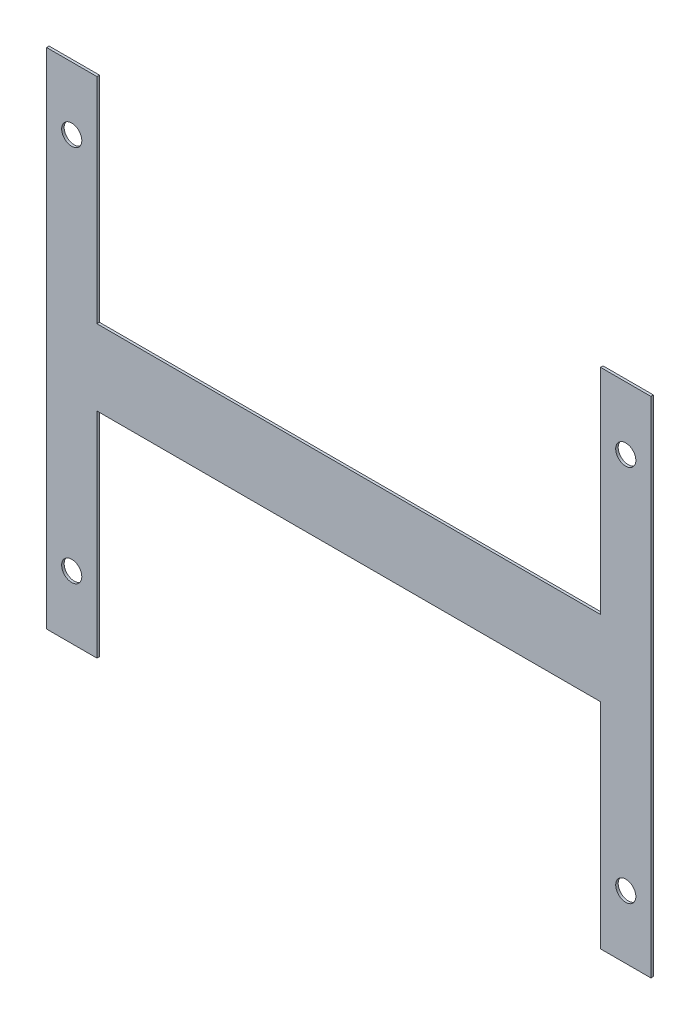
ISO-10303-21;
HEADER;
FILE_DESCRIPTION(('STEP AP214'),'2;1');
FILE_NAME('part.step','',(''),(''),'','','');
FILE_SCHEMA(('AUTOMOTIVE_DESIGN { 1 0 10303 214 1 1 1 1 }'));
ENDSEC;
DATA;
#1=APPLICATION_CONTEXT('core data for automotive mechanical design processes');
#2=APPLICATION_PROTOCOL_DEFINITION('international standard','automotive_design',2000,#1);
#3=PRODUCT_CONTEXT('',#1,'mechanical');
#4=PRODUCT('Part','Part','',(#3));
#5=PRODUCT_RELATED_PRODUCT_CATEGORY('part','',(#4));
#6=PRODUCT_DEFINITION_FORMATION('','',#4);
#7=PRODUCT_DEFINITION_CONTEXT('part definition',#1,'design');
#8=PRODUCT_DEFINITION('design','',#6,#7);
#9=PRODUCT_DEFINITION_SHAPE('','',#8);
#10=(LENGTH_UNIT() NAMED_UNIT(*) SI_UNIT(.MILLI.,.METRE.));
#11=(NAMED_UNIT(*) PLANE_ANGLE_UNIT() SI_UNIT($,.RADIAN.));
#12=(NAMED_UNIT(*) SI_UNIT($,.STERADIAN.) SOLID_ANGLE_UNIT());
#13=UNCERTAINTY_MEASURE_WITH_UNIT(LENGTH_MEASURE(1.E-05),#10,'distance_accuracy_value','');
#14=(GEOMETRIC_REPRESENTATION_CONTEXT(3) GLOBAL_UNCERTAINTY_ASSIGNED_CONTEXT((#13)) GLOBAL_UNIT_ASSIGNED_CONTEXT((#10,
#11,#12)) REPRESENTATION_CONTEXT('',''));
#15=CARTESIAN_POINT('',(0.,0.,0.));
#16=DIRECTION('',(0.,0.,1.));
#17=DIRECTION('',(1.,0.,0.));
#18=AXIS2_PLACEMENT_3D('',#15,#16,#17);
#19=CARTESIAN_POINT('',(0.,85.,1.));
#20=DIRECTION('',(0.,1.,0.));
#21=DIRECTION('',(-1.,0.,0.));
#22=AXIS2_PLACEMENT_3D('',#19,#20,#21);
#23=PLANE('',#22);
#24=DIRECTION('',(1.,0.,0.));
#25=VECTOR('',#24,1.);
#26=CARTESIAN_POINT('',(0.,85.,0.));
#27=LINE('',#26,#25);
#28=CARTESIAN_POINT('',(20.,85.,0.));
#29=VERTEX_POINT('',#28);
#30=CARTESIAN_POINT('',(220.,85.,0.));
#31=VERTEX_POINT('',#30);
#32=EDGE_CURVE('E170',#29,#31,#27,.T.);
#33=ORIENTED_EDGE('',*,*,#32,.T.);
#34=DIRECTION('',(0.,0.,-1.));
#35=VECTOR('',#34,1.);
#36=CARTESIAN_POINT('',(220.,85.,1.));
#37=LINE('',#36,#35);
#38=CARTESIAN_POINT('',(220.,85.,1.));
#39=VERTEX_POINT('',#38);
#40=EDGE_CURVE('E11',#39,#31,#37,.T.);
#41=ORIENTED_EDGE('',*,*,#40,.F.);
#42=DIRECTION('',(1.,0.,0.));
#43=VECTOR('',#42,1.);
#44=CARTESIAN_POINT('',(0.,85.,1.));
#45=LINE('',#44,#43);
#46=CARTESIAN_POINT('',(20.,85.,1.));
#47=VERTEX_POINT('',#46);
#48=EDGE_CURVE('E209',#47,#39,#45,.T.);
#49=ORIENTED_EDGE('',*,*,#48,.F.);
#50=DIRECTION('',(0.,0.,-1.));
#51=VECTOR('',#50,1.);
#52=CARTESIAN_POINT('',(20.,85.,1.));
#53=LINE('',#52,#51);
#54=EDGE_CURVE('E51',#47,#29,#53,.T.);
#55=ORIENTED_EDGE('',*,*,#54,.T.);
#56=EDGE_LOOP('',(#33,#41,#49,#55));
#57=FACE_BOUND('',#56,.T.);
#58=ADVANCED_FACE('F35',(#57),#23,.F.);
#59=CARTESIAN_POINT('',(220.,5.49560397189453E-13,1.));
#60=DIRECTION('',(1.,0.,0.));
#61=DIRECTION('',(0.,1.,0.));
#62=AXIS2_PLACEMENT_3D('',#59,#60,#61);
#63=PLANE('',#62);
#64=DIRECTION('',(0.,-1.,0.));
#65=VECTOR('',#64,1.);
#66=CARTESIAN_POINT('',(220.,5.49560397189453E-13,0.));
#67=LINE('',#66,#65);
#68=CARTESIAN_POINT('',(220.,6.10622663543836E-13,0.));
#69=VERTEX_POINT('',#68);
#70=EDGE_CURVE('E172',#31,#69,#67,.T.);
#71=ORIENTED_EDGE('',*,*,#70,.T.);
#72=DIRECTION('',(0.,0.,-1.));
#73=VECTOR('',#72,1.);
#74=CARTESIAN_POINT('',(220.,6.10622663543836E-13,1.));
#75=LINE('',#74,#73);
#76=CARTESIAN_POINT('',(220.,6.10622663543836E-13,1.));
#77=VERTEX_POINT('',#76);
#78=EDGE_CURVE('E43',#77,#69,#75,.T.);
#79=ORIENTED_EDGE('',*,*,#78,.F.);
#80=DIRECTION('',(0.,-1.,0.));
#81=VECTOR('',#80,1.);
#82=CARTESIAN_POINT('',(220.,5.49560397189453E-13,1.));
#83=LINE('',#82,#81);
#84=EDGE_CURVE('E102',#39,#77,#83,.T.);
#85=ORIENTED_EDGE('',*,*,#84,.F.);
#86=ORIENTED_EDGE('',*,*,#40,.T.);
#87=EDGE_LOOP('',(#71,#79,#85,#86));
#88=FACE_BOUND('',#87,.T.);
#89=ADVANCED_FACE('F231',(#88),#63,.F.);
#90=CARTESIAN_POINT('',(0.,0.,1.));
#91=DIRECTION('',(0.,-1.,0.));
#92=DIRECTION('',(1.,0.,0.));
#93=AXIS2_PLACEMENT_3D('',#90,#91,#92);
#94=PLANE('',#93);
#95=DIRECTION('',(-1.,0.,0.));
#96=VECTOR('',#95,1.);
#97=CARTESIAN_POINT('',(0.,0.,0.));
#98=LINE('',#97,#96);
#99=CARTESIAN_POINT('',(240.,6.66133814775094E-13,0.));
#100=VERTEX_POINT('',#99);
#101=EDGE_CURVE('E175',#100,#69,#98,.T.);
#102=ORIENTED_EDGE('',*,*,#101,.F.);
#103=DIRECTION('',(0.,0.,-1.));
#104=VECTOR('',#103,1.);
#105=CARTESIAN_POINT('',(240.,6.66133814775094E-13,1.));
#106=LINE('',#105,#104);
#107=CARTESIAN_POINT('',(240.,6.66133814775094E-13,1.));
#108=VERTEX_POINT('',#107);
#109=EDGE_CURVE('E224',#108,#100,#106,.T.);
#110=ORIENTED_EDGE('',*,*,#109,.F.);
#111=DIRECTION('',(-1.,0.,0.));
#112=VECTOR('',#111,1.);
#113=CARTESIAN_POINT('',(0.,0.,1.));
#114=LINE('',#113,#112);
#115=EDGE_CURVE('E230',#108,#77,#114,.T.);
#116=ORIENTED_EDGE('',*,*,#115,.T.);
#117=ORIENTED_EDGE('',*,*,#78,.T.);
#118=EDGE_LOOP('',(#102,#110,#116,#117));
#119=FACE_BOUND('',#118,.T.);
#120=ADVANCED_FACE('F228',(#119),#94,.T.);
#121=CARTESIAN_POINT('',(240.,6.66133814775095E-13,1.));
#122=DIRECTION('',(1.,0.,0.));
#123=DIRECTION('',(0.,1.,0.));
#124=AXIS2_PLACEMENT_3D('',#121,#122,#123);
#125=PLANE('',#124);
#126=DIRECTION('',(0.,-1.,0.));
#127=VECTOR('',#126,1.);
#128=CARTESIAN_POINT('',(240.,6.66133814775095E-13,0.));
#129=LINE('',#128,#127);
#130=CARTESIAN_POINT('',(240.,200.,0.));
#131=VERTEX_POINT('',#130);
#132=EDGE_CURVE('E179',#131,#100,#129,.T.);
#133=ORIENTED_EDGE('',*,*,#132,.F.);
#134=DIRECTION('',(0.,0.,-1.));
#135=VECTOR('',#134,1.);
#136=CARTESIAN_POINT('',(240.,200.,1.));
#137=LINE('',#136,#135);
#138=CARTESIAN_POINT('',(240.,200.,1.));
#139=VERTEX_POINT('',#138);
#140=EDGE_CURVE('E222',#139,#131,#137,.T.);
#141=ORIENTED_EDGE('',*,*,#140,.F.);
#142=DIRECTION('',(0.,-1.,0.));
#143=VECTOR('',#142,1.);
#144=CARTESIAN_POINT('',(240.,6.66133814775095E-13,1.));
#145=LINE('',#144,#143);
#146=EDGE_CURVE('E244',#139,#108,#145,.T.);
#147=ORIENTED_EDGE('',*,*,#146,.T.);
#148=ORIENTED_EDGE('',*,*,#109,.T.);
#149=EDGE_LOOP('',(#133,#141,#147,#148));
#150=FACE_BOUND('',#149,.T.);
#151=ADVANCED_FACE('F240',(#150),#125,.T.);
#152=CARTESIAN_POINT('',(-5.55111512312578E-13,200.,1.));
#153=DIRECTION('',(0.,-1.,0.));
#154=DIRECTION('',(1.,0.,0.));
#155=AXIS2_PLACEMENT_3D('',#152,#153,#154);
#156=PLANE('',#155);
#157=DIRECTION('',(-1.,0.,0.));
#158=VECTOR('',#157,1.);
#159=CARTESIAN_POINT('',(-5.55111512312578E-13,200.,0.));
#160=LINE('',#159,#158);
#161=CARTESIAN_POINT('',(220.,200.,0.));
#162=VERTEX_POINT('',#161);
#163=EDGE_CURVE('E182',#131,#162,#160,.T.);
#164=ORIENTED_EDGE('',*,*,#163,.T.);
#165=DIRECTION('',(0.,0.,-1.));
#166=VECTOR('',#165,1.);
#167=CARTESIAN_POINT('',(220.,200.,1.));
#168=LINE('',#167,#166);
#169=CARTESIAN_POINT('',(220.,200.,1.));
#170=VERTEX_POINT('',#169);
#171=EDGE_CURVE('E219',#170,#162,#168,.T.);
#172=ORIENTED_EDGE('',*,*,#171,.F.);
#173=DIRECTION('',(-1.,0.,0.));
#174=VECTOR('',#173,1.);
#175=CARTESIAN_POINT('',(-5.55111512312578E-13,200.,1.));
#176=LINE('',#175,#174);
#177=EDGE_CURVE('E246',#139,#170,#176,.T.);
#178=ORIENTED_EDGE('',*,*,#177,.F.);
#179=ORIENTED_EDGE('',*,*,#140,.T.);
#180=EDGE_LOOP('',(#164,#172,#178,#179));
#181=FACE_BOUND('',#180,.T.);
#182=ADVANCED_FACE('F292',(#181),#156,.F.);
#183=CARTESIAN_POINT('',(220.,115.,0.));
#184=VERTEX_POINT('',#183);
#185=EDGE_CURVE('E176',#162,#184,#67,.T.);
#186=ORIENTED_EDGE('',*,*,#185,.T.);
#187=DIRECTION('',(0.,0.,-1.));
#188=VECTOR('',#187,1.);
#189=CARTESIAN_POINT('',(220.,115.,1.));
#190=LINE('',#189,#188);
#191=CARTESIAN_POINT('',(220.,115.,1.));
#192=VERTEX_POINT('',#191);
#193=EDGE_CURVE('E217',#192,#184,#190,.T.);
#194=ORIENTED_EDGE('',*,*,#193,.F.);
#195=EDGE_CURVE('E249',#170,#192,#83,.T.);
#196=ORIENTED_EDGE('',*,*,#195,.F.);
#197=ORIENTED_EDGE('',*,*,#171,.T.);
#198=EDGE_LOOP('',(#186,#194,#196,#197));
#199=FACE_BOUND('',#198,.T.);
#200=ADVANCED_FACE('F285',(#199),#63,.F.);
#201=CARTESIAN_POINT('',(0.,115.,1.));
#202=DIRECTION('',(0.,1.,0.));
#203=DIRECTION('',(0.,0.,1.));
#204=AXIS2_PLACEMENT_3D('',#201,#202,#203);
#205=PLANE('',#204);
#206=DIRECTION('',(1.,0.,0.));
#207=VECTOR('',#206,1.);
#208=CARTESIAN_POINT('',(0.,115.,0.));
#209=LINE('',#208,#207);
#210=CARTESIAN_POINT('',(20.,115.,0.));
#211=VERTEX_POINT('',#210);
#212=EDGE_CURVE('E184',#211,#184,#209,.T.);
#213=ORIENTED_EDGE('',*,*,#212,.F.);
#214=DIRECTION('',(0.,0.,-1.));
#215=VECTOR('',#214,1.);
#216=CARTESIAN_POINT('',(20.,115.,1.));
#217=LINE('',#216,#215);
#218=CARTESIAN_POINT('',(20.,115.,1.));
#219=VERTEX_POINT('',#218);
#220=EDGE_CURVE('E215',#219,#211,#217,.T.);
#221=ORIENTED_EDGE('',*,*,#220,.F.);
#222=DIRECTION('',(1.,0.,0.));
#223=VECTOR('',#222,1.);
#224=CARTESIAN_POINT('',(0.,115.,1.));
#225=LINE('',#224,#223);
#226=EDGE_CURVE('E253',#219,#192,#225,.T.);
#227=ORIENTED_EDGE('',*,*,#226,.T.);
#228=ORIENTED_EDGE('',*,*,#193,.T.);
#229=EDGE_LOOP('',(#213,#221,#227,#228));
#230=FACE_BOUND('',#229,.T.);
#231=ADVANCED_FACE('F278',(#230),#205,.T.);
#232=CARTESIAN_POINT('',(20.,0.,1.));
#233=DIRECTION('',(1.,0.,0.));
#234=DIRECTION('',(0.,1.,0.));
#235=AXIS2_PLACEMENT_3D('',#232,#233,#234);
#236=PLANE('',#235);
#237=DIRECTION('',(0.,-1.,0.));
#238=VECTOR('',#237,1.);
#239=CARTESIAN_POINT('',(20.,0.,0.));
#240=LINE('',#239,#238);
#241=CARTESIAN_POINT('',(20.,200.,0.));
#242=VERTEX_POINT('',#241);
#243=EDGE_CURVE('E187',#242,#211,#240,.T.);
#244=ORIENTED_EDGE('',*,*,#243,.F.);
#245=DIRECTION('',(0.,0.,-1.));
#246=VECTOR('',#245,1.);
#247=CARTESIAN_POINT('',(20.,200.,1.));
#248=LINE('',#247,#246);
#249=CARTESIAN_POINT('',(20.,200.,1.));
#250=VERTEX_POINT('',#249);
#251=EDGE_CURVE('E213',#250,#242,#248,.T.);
#252=ORIENTED_EDGE('',*,*,#251,.F.);
#253=DIRECTION('',(0.,-1.,0.));
#254=VECTOR('',#253,1.);
#255=CARTESIAN_POINT('',(20.,0.,1.));
#256=LINE('',#255,#254);
#257=EDGE_CURVE('E156',#250,#219,#256,.T.);
#258=ORIENTED_EDGE('',*,*,#257,.T.);
#259=ORIENTED_EDGE('',*,*,#220,.T.);
#260=EDGE_LOOP('',(#244,#252,#258,#259));
#261=FACE_BOUND('',#260,.T.);
#262=ADVANCED_FACE('F266',(#261),#236,.T.);
#263=CARTESIAN_POINT('',(0.,200.,1.));
#264=DIRECTION('',(0.,1.,0.));
#265=DIRECTION('',(0.,0.,1.));
#266=AXIS2_PLACEMENT_3D('',#263,#264,#265);
#267=PLANE('',#266);
#268=DIRECTION('',(1.,0.,0.));
#269=VECTOR('',#268,1.);
#270=CARTESIAN_POINT('',(0.,200.,0.));
#271=LINE('',#270,#269);
#272=CARTESIAN_POINT('',(0.,200.,0.));
#273=VERTEX_POINT('',#272);
#274=EDGE_CURVE('E190',#273,#242,#271,.T.);
#275=ORIENTED_EDGE('',*,*,#274,.F.);
#276=DIRECTION('',(0.,0.,-1.));
#277=VECTOR('',#276,1.);
#278=CARTESIAN_POINT('',(0.,200.,1.));
#279=LINE('',#278,#277);
#280=CARTESIAN_POINT('',(0.,200.,1.));
#281=VERTEX_POINT('',#280);
#282=EDGE_CURVE('E149',#281,#273,#279,.T.);
#283=ORIENTED_EDGE('',*,*,#282,.F.);
#284=DIRECTION('',(1.,0.,0.));
#285=VECTOR('',#284,1.);
#286=CARTESIAN_POINT('',(0.,200.,1.));
#287=LINE('',#286,#285);
#288=EDGE_CURVE('E139',#281,#250,#287,.T.);
#289=ORIENTED_EDGE('',*,*,#288,.T.);
#290=ORIENTED_EDGE('',*,*,#251,.T.);
#291=EDGE_LOOP('',(#275,#283,#289,#290));
#292=FACE_BOUND('',#291,.T.);
#293=ADVANCED_FACE('F258',(#292),#267,.T.);
#294=CARTESIAN_POINT('',(0.,0.,1.));
#295=DIRECTION('',(1.,0.,0.));
#296=DIRECTION('',(0.,0.,-1.));
#297=AXIS2_PLACEMENT_3D('',#294,#295,#296);
#298=PLANE('',#297);
#299=DIRECTION('',(0.,-1.,0.));
#300=VECTOR('',#299,1.);
#301=CARTESIAN_POINT('',(0.,0.,0.));
#302=LINE('',#301,#300);
#303=CARTESIAN_POINT('',(0.,0.,0.));
#304=VERTEX_POINT('',#303);
#305=EDGE_CURVE('E146',#273,#304,#302,.T.);
#306=ORIENTED_EDGE('',*,*,#305,.T.);
#307=DIRECTION('',(0.,0.,-1.));
#308=VECTOR('',#307,1.);
#309=CARTESIAN_POINT('',(0.,0.,1.));
#310=LINE('',#309,#308);
#311=CARTESIAN_POINT('',(0.,0.,1.));
#312=VERTEX_POINT('',#311);
#313=EDGE_CURVE('E143',#312,#304,#310,.T.);
#314=ORIENTED_EDGE('',*,*,#313,.F.);
#315=DIRECTION('',(0.,-1.,0.));
#316=VECTOR('',#315,1.);
#317=CARTESIAN_POINT('',(0.,0.,1.));
#318=LINE('',#317,#316);
#319=EDGE_CURVE('E130',#281,#312,#318,.T.);
#320=ORIENTED_EDGE('',*,*,#319,.F.);
#321=ORIENTED_EDGE('',*,*,#282,.T.);
#322=EDGE_LOOP('',(#306,#314,#320,#321));
#323=FACE_BOUND('',#322,.T.);
#324=ADVANCED_FACE('F144',(#323),#298,.F.);
#325=CARTESIAN_POINT('',(0.,0.,1.));
#326=DIRECTION('',(0.,1.,0.));
#327=DIRECTION('',(0.,0.,1.));
#328=AXIS2_PLACEMENT_3D('',#325,#326,#327);
#329=PLANE('',#328);
#330=DIRECTION('',(1.,0.,0.));
#331=VECTOR('',#330,1.);
#332=CARTESIAN_POINT('',(0.,0.,0.));
#333=LINE('',#332,#331);
#334=CARTESIAN_POINT('',(20.,0.,0.));
#335=VERTEX_POINT('',#334);
#336=EDGE_CURVE('E195',#304,#335,#333,.T.);
#337=ORIENTED_EDGE('',*,*,#336,.T.);
#338=DIRECTION('',(0.,0.,-1.));
#339=VECTOR('',#338,1.);
#340=CARTESIAN_POINT('',(20.,0.,1.));
#341=LINE('',#340,#339);
#342=CARTESIAN_POINT('',(20.,0.,1.));
#343=VERTEX_POINT('',#342);
#344=EDGE_CURVE('E90',#343,#335,#341,.T.);
#345=ORIENTED_EDGE('',*,*,#344,.F.);
#346=DIRECTION('',(1.,0.,0.));
#347=VECTOR('',#346,1.);
#348=CARTESIAN_POINT('',(0.,0.,1.));
#349=LINE('',#348,#347);
#350=EDGE_CURVE('E136',#312,#343,#349,.T.);
#351=ORIENTED_EDGE('',*,*,#350,.F.);
#352=ORIENTED_EDGE('',*,*,#313,.T.);
#353=EDGE_LOOP('',(#337,#345,#351,#352));
#354=FACE_BOUND('',#353,.T.);
#355=ADVANCED_FACE('F151',(#354),#329,.F.);
#356=CARTESIAN_POINT('',(230.,25.0000000000003,1.));
#357=DIRECTION('',(0.,0.,-1.));
#358=DIRECTION('',(-1.,0.,0.));
#359=AXIS2_PLACEMENT_3D('',#356,#357,#358);
#360=CYLINDRICAL_SURFACE('',#359,4.00000000000002);
#361=CARTESIAN_POINT('',(230.,25.0000000000003,1.));
#362=DIRECTION('',(0.,0.,1.));
#363=DIRECTION('',(1.,0.,0.));
#364=AXIS2_PLACEMENT_3D('',#361,#362,#363);
#365=CIRCLE('',#364,4.00000000000002);
#366=CARTESIAN_POINT('',(234.,25.0000000000003,1.));
#367=VERTEX_POINT('',#366);
#368=EDGE_CURVE('E164',#367,#367,#365,.T.);
#369=ORIENTED_EDGE('',*,*,#368,.T.);
#370=EDGE_LOOP('',(#369));
#371=FACE_BOUND('',#370,.T.);
#372=CARTESIAN_POINT('',(230.,25.0000000000003,0.));
#373=DIRECTION('',(0.,0.,1.));
#374=DIRECTION('',(1.,0.,0.));
#375=AXIS2_PLACEMENT_3D('',#372,#373,#374);
#376=CIRCLE('',#375,4.00000000000002);
#377=CARTESIAN_POINT('',(234.,25.0000000000003,0.));
#378=VERTEX_POINT('',#377);
#379=EDGE_CURVE('E203',#378,#378,#376,.T.);
#380=ORIENTED_EDGE('',*,*,#379,.F.);
#381=EDGE_LOOP('',(#380));
#382=FACE_BOUND('',#381,.T.);
#383=ADVANCED_FACE('F377',(#371,#382),#360,.F.);
#384=CARTESIAN_POINT('',(9.99999999999998,25.,1.));
#385=DIRECTION('',(0.,0.,-1.));
#386=DIRECTION('',(-1.,0.,0.));
#387=AXIS2_PLACEMENT_3D('',#384,#385,#386);
#388=CYLINDRICAL_SURFACE('',#387,4.);
#389=CARTESIAN_POINT('',(9.99999999999998,25.,1.));
#390=DIRECTION('',(0.,0.,1.));
#391=DIRECTION('',(1.,0.,0.));
#392=AXIS2_PLACEMENT_3D('',#389,#390,#391);
#393=CIRCLE('',#392,4.);
#394=CARTESIAN_POINT('',(14.,25.,1.));
#395=VERTEX_POINT('',#394);
#396=EDGE_CURVE('E161',#395,#395,#393,.F.);
#397=ORIENTED_EDGE('',*,*,#396,.F.);
#398=EDGE_LOOP('',(#397));
#399=FACE_BOUND('',#398,.T.);
#400=CARTESIAN_POINT('',(9.99999999999998,25.,0.));
#401=DIRECTION('',(0.,0.,1.));
#402=DIRECTION('',(1.,0.,0.));
#403=AXIS2_PLACEMENT_3D('',#400,#401,#402);
#404=CIRCLE('',#403,4.);
#405=CARTESIAN_POINT('',(14.,25.,0.));
#406=VERTEX_POINT('',#405);
#407=EDGE_CURVE('E200',#406,#406,#404,.F.);
#408=ORIENTED_EDGE('',*,*,#407,.T.);
#409=EDGE_LOOP('',(#408));
#410=FACE_BOUND('',#409,.T.);
#411=ADVANCED_FACE('F273',(#399,#410),#388,.F.);
#412=CARTESIAN_POINT('',(9.99999999999998,175.,1.));
#413=DIRECTION('',(0.,0.,-1.));
#414=DIRECTION('',(-1.,0.,0.));
#415=AXIS2_PLACEMENT_3D('',#412,#413,#414);
#416=CYLINDRICAL_SURFACE('',#415,4.);
#417=CARTESIAN_POINT('',(9.99999999999998,175.,1.));
#418=DIRECTION('',(0.,0.,1.));
#419=DIRECTION('',(1.,0.,0.));
#420=AXIS2_PLACEMENT_3D('',#417,#418,#419);
#421=CIRCLE('',#420,4.);
#422=CARTESIAN_POINT('',(14.,175.,1.));
#423=VERTEX_POINT('',#422);
#424=EDGE_CURVE('E154',#423,#423,#421,.T.);
#425=ORIENTED_EDGE('',*,*,#424,.T.);
#426=EDGE_LOOP('',(#425));
#427=FACE_BOUND('',#426,.T.);
#428=CARTESIAN_POINT('',(9.99999999999998,175.,0.));
#429=DIRECTION('',(0.,0.,1.));
#430=DIRECTION('',(1.,0.,0.));
#431=AXIS2_PLACEMENT_3D('',#428,#429,#430);
#432=CIRCLE('',#431,4.);
#433=CARTESIAN_POINT('',(14.,175.,0.));
#434=VERTEX_POINT('',#433);
#435=EDGE_CURVE('E197',#434,#434,#432,.T.);
#436=ORIENTED_EDGE('',*,*,#435,.F.);
#437=EDGE_LOOP('',(#436));
#438=FACE_BOUND('',#437,.T.);
#439=ADVANCED_FACE('F264',(#427,#438),#416,.F.);
#440=EDGE_CURVE('E191',#29,#335,#240,.T.);
#441=ORIENTED_EDGE('',*,*,#440,.F.);
#442=ORIENTED_EDGE('',*,*,#54,.F.);
#443=EDGE_CURVE('E152',#47,#343,#256,.T.);
#444=ORIENTED_EDGE('',*,*,#443,.T.);
#445=ORIENTED_EDGE('',*,*,#344,.T.);
#446=EDGE_LOOP('',(#441,#442,#444,#445));
#447=FACE_BOUND('',#446,.T.);
#448=ADVANCED_FACE('F261',(#447),#236,.T.);
#449=CARTESIAN_POINT('',(230.,175.,1.));
#450=DIRECTION('',(0.,0.,-1.));
#451=DIRECTION('',(-1.,0.,0.));
#452=AXIS2_PLACEMENT_3D('',#449,#450,#451);
#453=CYLINDRICAL_SURFACE('',#452,4.00000000000002);
#454=CARTESIAN_POINT('',(230.,175.,1.));
#455=DIRECTION('',(0.,0.,1.));
#456=DIRECTION('',(1.,0.,0.));
#457=AXIS2_PLACEMENT_3D('',#454,#455,#456);
#458=CIRCLE('',#457,4.00000000000002);
#459=CARTESIAN_POINT('',(234.,175.,1.));
#460=VERTEX_POINT('',#459);
#461=EDGE_CURVE('E167',#460,#460,#458,.F.);
#462=ORIENTED_EDGE('',*,*,#461,.F.);
#463=EDGE_LOOP('',(#462));
#464=FACE_BOUND('',#463,.T.);
#465=CARTESIAN_POINT('',(230.,175.,0.));
#466=DIRECTION('',(0.,0.,1.));
#467=DIRECTION('',(1.,0.,0.));
#468=AXIS2_PLACEMENT_3D('',#465,#466,#467);
#469=CIRCLE('',#468,4.00000000000002);
#470=CARTESIAN_POINT('',(234.,175.,0.));
#471=VERTEX_POINT('',#470);
#472=EDGE_CURVE('E206',#471,#471,#469,.F.);
#473=ORIENTED_EDGE('',*,*,#472,.T.);
#474=EDGE_LOOP('',(#473));
#475=FACE_BOUND('',#474,.T.);
#476=ADVANCED_FACE('F263',(#464,#475),#453,.F.);
#477=CARTESIAN_POINT('',(0.,0.,1.));
#478=DIRECTION('',(0.,0.,1.));
#479=DIRECTION('',(1.,0.,0.));
#480=AXIS2_PLACEMENT_3D('',#477,#478,#479);
#481=PLANE('',#480);
#482=ORIENTED_EDGE('',*,*,#48,.T.);
#483=ORIENTED_EDGE('',*,*,#84,.T.);
#484=ORIENTED_EDGE('',*,*,#115,.F.);
#485=ORIENTED_EDGE('',*,*,#146,.F.);
#486=ORIENTED_EDGE('',*,*,#177,.T.);
#487=ORIENTED_EDGE('',*,*,#195,.T.);
#488=ORIENTED_EDGE('',*,*,#226,.F.);
#489=ORIENTED_EDGE('',*,*,#257,.F.);
#490=ORIENTED_EDGE('',*,*,#288,.F.);
#491=ORIENTED_EDGE('',*,*,#319,.T.);
#492=ORIENTED_EDGE('',*,*,#350,.T.);
#493=ORIENTED_EDGE('',*,*,#443,.F.);
#494=EDGE_LOOP('',(#482,#483,#484,#485,#486,#487,#488,#489,#490,#491,#492,#493));
#495=FACE_BOUND('',#494,.T.);
#496=ORIENTED_EDGE('',*,*,#424,.F.);
#497=EDGE_LOOP('',(#496));
#498=FACE_BOUND('',#497,.T.);
#499=ORIENTED_EDGE('',*,*,#396,.T.);
#500=EDGE_LOOP('',(#499));
#501=FACE_BOUND('',#500,.T.);
#502=ORIENTED_EDGE('',*,*,#368,.F.);
#503=EDGE_LOOP('',(#502));
#504=FACE_BOUND('',#503,.T.);
#505=ORIENTED_EDGE('',*,*,#461,.T.);
#506=EDGE_LOOP('',(#505));
#507=FACE_BOUND('',#506,.T.);
#508=ADVANCED_FACE('F132',(#495,#498,#501,#504,#507),#481,.T.);
#509=CARTESIAN_POINT('',(0.,0.,0.));
#510=DIRECTION('',(0.,0.,1.));
#511=DIRECTION('',(1.,0.,0.));
#512=AXIS2_PLACEMENT_3D('',#509,#510,#511);
#513=PLANE('',#512);
#514=ORIENTED_EDGE('',*,*,#32,.F.);
#515=ORIENTED_EDGE('',*,*,#440,.T.);
#516=ORIENTED_EDGE('',*,*,#336,.F.);
#517=ORIENTED_EDGE('',*,*,#305,.F.);
#518=ORIENTED_EDGE('',*,*,#274,.T.);
#519=ORIENTED_EDGE('',*,*,#243,.T.);
#520=ORIENTED_EDGE('',*,*,#212,.T.);
#521=ORIENTED_EDGE('',*,*,#185,.F.);
#522=ORIENTED_EDGE('',*,*,#163,.F.);
#523=ORIENTED_EDGE('',*,*,#132,.T.);
#524=ORIENTED_EDGE('',*,*,#101,.T.);
#525=ORIENTED_EDGE('',*,*,#70,.F.);
#526=EDGE_LOOP('',(#514,#515,#516,#517,#518,#519,#520,#521,#522,#523,#524,#525));
#527=FACE_BOUND('',#526,.T.);
#528=ORIENTED_EDGE('',*,*,#435,.T.);
#529=EDGE_LOOP('',(#528));
#530=FACE_BOUND('',#529,.T.);
#531=ORIENTED_EDGE('',*,*,#407,.F.);
#532=EDGE_LOOP('',(#531));
#533=FACE_BOUND('',#532,.T.);
#534=ORIENTED_EDGE('',*,*,#379,.T.);
#535=EDGE_LOOP('',(#534));
#536=FACE_BOUND('',#535,.T.);
#537=ORIENTED_EDGE('',*,*,#472,.F.);
#538=EDGE_LOOP('',(#537));
#539=FACE_BOUND('',#538,.T.);
#540=ADVANCED_FACE('F234',(#527,#530,#533,#536,#539),#513,.F.);
#541=CLOSED_SHELL('',(#58,#89,#120,#151,#182,#200,#231,#262,#293,#324,#355,#383,#411,#439,#448,
#476,#508,#540));
#542=MANIFOLD_SOLID_BREP('B2',#541);
#543=ADVANCED_BREP_SHAPE_REPRESENTATION('',(#18,#542),#14);
#544=SHAPE_DEFINITION_REPRESENTATION(#9,#543);
ENDSEC;
END-ISO-10303-21;
